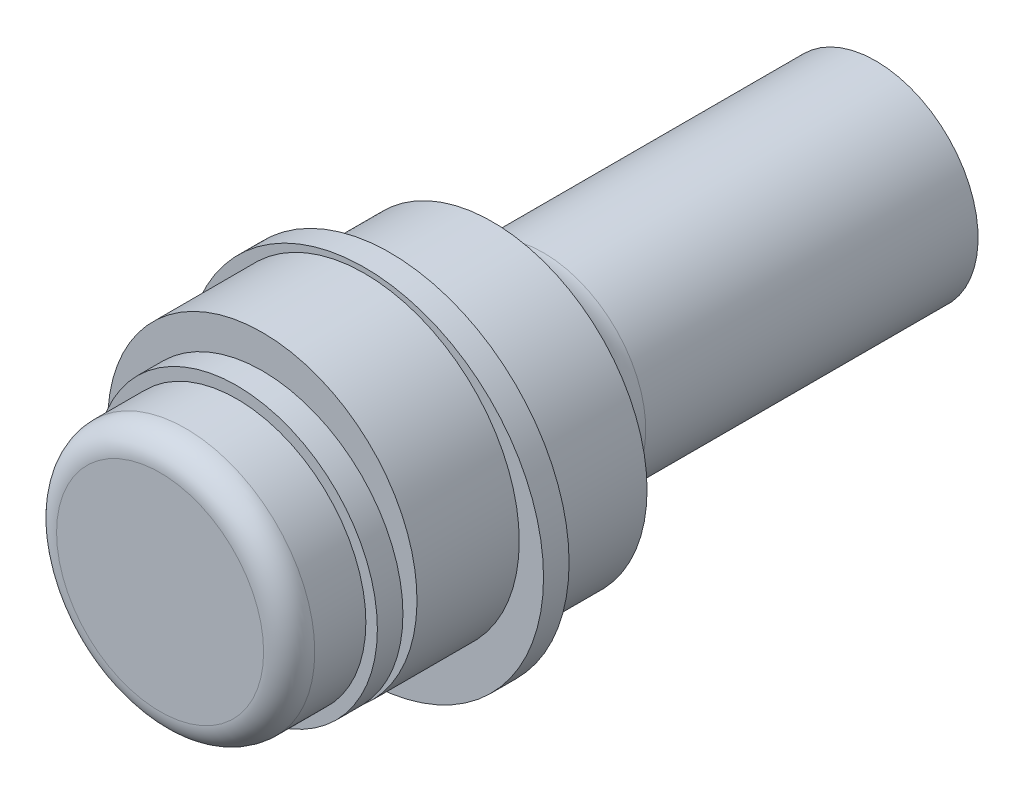
ISO-10303-21;
HEADER;
FILE_DESCRIPTION(('STEP AP214'),'2;1');
FILE_NAME('part.step','',(''),(''),'','','');
FILE_SCHEMA(('AUTOMOTIVE_DESIGN { 1 0 10303 214 1 1 1 1 }'));
ENDSEC;
DATA;
#1=APPLICATION_CONTEXT('core data for automotive mechanical design processes');
#2=APPLICATION_PROTOCOL_DEFINITION('international standard','automotive_design',2000,#1);
#3=PRODUCT_CONTEXT('',#1,'mechanical');
#4=PRODUCT('Part','Part','',(#3));
#5=PRODUCT_RELATED_PRODUCT_CATEGORY('part','',(#4));
#6=PRODUCT_DEFINITION_FORMATION('','',#4);
#7=PRODUCT_DEFINITION_CONTEXT('part definition',#1,'design');
#8=PRODUCT_DEFINITION('design','',#6,#7);
#9=PRODUCT_DEFINITION_SHAPE('','',#8);
#10=(LENGTH_UNIT() NAMED_UNIT(*) SI_UNIT(.MILLI.,.METRE.));
#11=(NAMED_UNIT(*) PLANE_ANGLE_UNIT() SI_UNIT($,.RADIAN.));
#12=(NAMED_UNIT(*) SI_UNIT($,.STERADIAN.) SOLID_ANGLE_UNIT());
#13=UNCERTAINTY_MEASURE_WITH_UNIT(LENGTH_MEASURE(1.E-05),#10,'distance_accuracy_value','');
#14=(GEOMETRIC_REPRESENTATION_CONTEXT(3) GLOBAL_UNCERTAINTY_ASSIGNED_CONTEXT((#13)) GLOBAL_UNIT_ASSIGNED_CONTEXT((#10,
#11,#12)) REPRESENTATION_CONTEXT('',''));
#15=CARTESIAN_POINT('',(0.,0.,0.));
#16=DIRECTION('',(0.,0.,1.));
#17=DIRECTION('',(1.,0.,0.));
#18=AXIS2_PLACEMENT_3D('',#15,#16,#17);
#19=CARTESIAN_POINT('',(0.,0.,5.));
#20=DIRECTION('',(0.,0.,-1.));
#21=DIRECTION('',(-1.,0.,0.));
#22=AXIS2_PLACEMENT_3D('',#19,#20,#21);
#23=CYLINDRICAL_SURFACE('',#22,6.05);
#24=CARTESIAN_POINT('',(0.,0.,0.));
#25=DIRECTION('',(0.,0.,1.));
#26=DIRECTION('',(1.,0.,0.));
#27=AXIS2_PLACEMENT_3D('',#24,#25,#26);
#28=CIRCLE('',#27,6.05);
#29=CARTESIAN_POINT('',(6.05,0.,0.));
#30=VERTEX_POINT('',#29);
#31=EDGE_CURVE('E128',#30,#30,#28,.T.);
#32=ORIENTED_EDGE('',*,*,#31,.T.);
#33=EDGE_LOOP('',(#32));
#34=FACE_BOUND('',#33,.T.);
#35=CARTESIAN_POINT('',(0.,0.,4.));
#36=DIRECTION('',(0.,0.,1.));
#37=DIRECTION('',(1.,0.,0.));
#38=AXIS2_PLACEMENT_3D('',#35,#36,#37);
#39=CIRCLE('',#38,6.05);
#40=CARTESIAN_POINT('',(6.05,0.,4.));
#41=VERTEX_POINT('',#40);
#42=EDGE_CURVE('E124',#41,#41,#39,.T.);
#43=ORIENTED_EDGE('',*,*,#42,.F.);
#44=EDGE_LOOP('',(#43));
#45=FACE_BOUND('',#44,.T.);
#46=ADVANCED_FACE('F43',(#34,#45),#23,.T.);
#47=CARTESIAN_POINT('',(0.,0.,0.));
#48=DIRECTION('',(0.,0.,1.));
#49=DIRECTION('',(1.,0.,0.));
#50=AXIS2_PLACEMENT_3D('',#47,#48,#49);
#51=PLANE('',#50);
#52=CARTESIAN_POINT('',(0.,0.,0.));
#53=DIRECTION('',(0.,0.,1.));
#54=DIRECTION('',(1.,0.,0.));
#55=AXIS2_PLACEMENT_3D('',#52,#53,#54);
#56=CIRCLE('',#55,6.);
#57=CARTESIAN_POINT('',(3.3166247903554,-5.,0.));
#58=VERTEX_POINT('',#57);
#59=CARTESIAN_POINT('',(-3.3166247903554,-5.,0.));
#60=VERTEX_POINT('',#59);
#61=EDGE_CURVE('E64',#58,#60,#56,.T.);
#62=ORIENTED_EDGE('',*,*,#61,.T.);
#63=DIRECTION('',(-1.,0.,0.));
#64=VECTOR('',#63,1.);
#65=CARTESIAN_POINT('',(2.64575131106459,-5.,0.));
#66=LINE('',#65,#64);
#67=EDGE_CURVE('E138',#60,#58,#66,.F.);
#68=ORIENTED_EDGE('',*,*,#67,.T.);
#69=EDGE_LOOP('',(#62,#68));
#70=FACE_BOUND('',#69,.T.);
#71=ORIENTED_EDGE('',*,*,#31,.F.);
#72=EDGE_LOOP('',(#71));
#73=FACE_BOUND('',#72,.T.);
#74=ADVANCED_FACE('F167',(#70,#73),#51,.F.);
#75=CARTESIAN_POINT('',(0.,0.,4.));
#76=DIRECTION('',(0.,0.,1.));
#77=DIRECTION('',(1.,0.,0.));
#78=AXIS2_PLACEMENT_3D('',#75,#76,#77);
#79=CYLINDRICAL_SURFACE('',#78,7.);
#80=CARTESIAN_POINT('',(0.,0.,4.));
#81=DIRECTION('',(0.,0.,1.));
#82=DIRECTION('',(1.,0.,0.));
#83=AXIS2_PLACEMENT_3D('',#80,#81,#82);
#84=CIRCLE('',#83,7.);
#85=CARTESIAN_POINT('',(7.,0.,4.));
#86=VERTEX_POINT('',#85);
#87=EDGE_CURVE('E125',#86,#86,#84,.T.);
#88=ORIENTED_EDGE('',*,*,#87,.T.);
#89=EDGE_LOOP('',(#88));
#90=FACE_BOUND('',#89,.T.);
#91=CARTESIAN_POINT('',(0.,0.,5.));
#92=DIRECTION('',(0.,0.,1.));
#93=DIRECTION('',(1.,0.,0.));
#94=AXIS2_PLACEMENT_3D('',#91,#92,#93);
#95=CIRCLE('',#94,7.);
#96=CARTESIAN_POINT('',(7.,0.,5.));
#97=VERTEX_POINT('',#96);
#98=EDGE_CURVE('E92',#97,#97,#95,.T.);
#99=ORIENTED_EDGE('',*,*,#98,.F.);
#100=EDGE_LOOP('',(#99));
#101=FACE_BOUND('',#100,.T.);
#102=ADVANCED_FACE('F172',(#90,#101),#79,.T.);
#103=CARTESIAN_POINT('',(0.,0.,4.));
#104=DIRECTION('',(0.,0.,1.));
#105=DIRECTION('',(1.,0.,0.));
#106=AXIS2_PLACEMENT_3D('',#103,#104,#105);
#107=PLANE('',#106);
#108=ORIENTED_EDGE('',*,*,#42,.T.);
#109=EDGE_LOOP('',(#108));
#110=FACE_BOUND('',#109,.T.);
#111=ORIENTED_EDGE('',*,*,#87,.F.);
#112=EDGE_LOOP('',(#111));
#113=FACE_BOUND('',#112,.T.);
#114=ADVANCED_FACE('F179',(#110,#113),#107,.F.);
#115=CARTESIAN_POINT('',(0.,0.,5.));
#116=DIRECTION('',(0.,0.,1.));
#117=DIRECTION('',(1.,0.,0.));
#118=AXIS2_PLACEMENT_3D('',#115,#116,#117);
#119=PLANE('',#118);
#120=CARTESIAN_POINT('',(0.,0.75,5.));
#121=DIRECTION('',(0.,0.,1.));
#122=DIRECTION('',(1.,0.,0.));
#123=AXIS2_PLACEMENT_3D('',#120,#121,#122);
#124=CIRCLE('',#123,6.05);
#125=CARTESIAN_POINT('',(6.05,0.75,5.));
#126=VERTEX_POINT('',#125);
#127=EDGE_CURVE('E120',#126,#126,#124,.T.);
#128=ORIENTED_EDGE('',*,*,#127,.F.);
#129=EDGE_LOOP('',(#128));
#130=FACE_BOUND('',#129,.T.);
#131=ORIENTED_EDGE('',*,*,#98,.T.);
#132=EDGE_LOOP('',(#131));
#133=FACE_BOUND('',#132,.T.);
#134=ADVANCED_FACE('F176',(#130,#133),#119,.T.);
#135=CARTESIAN_POINT('',(0.,0.75,9.));
#136=DIRECTION('',(0.,0.,-1.));
#137=DIRECTION('',(-1.,0.,0.));
#138=AXIS2_PLACEMENT_3D('',#135,#136,#137);
#139=CYLINDRICAL_SURFACE('',#138,6.05);
#140=CARTESIAN_POINT('',(0.,0.75,9.));
#141=DIRECTION('',(0.,0.,1.));
#142=DIRECTION('',(1.,0.,0.));
#143=AXIS2_PLACEMENT_3D('',#140,#141,#142);
#144=CIRCLE('',#143,6.05);
#145=CARTESIAN_POINT('',(-3.91795865215548,-3.86,9.));
#146=VERTEX_POINT('',#145);
#147=CARTESIAN_POINT('',(3.91795865215548,-3.86,9.));
#148=VERTEX_POINT('',#147);
#149=EDGE_CURVE('E85',#146,#148,#144,.T.);
#150=ORIENTED_EDGE('',*,*,#149,.F.);
#151=EDGE_CURVE('E88',#148,#146,#144,.T.);
#152=ORIENTED_EDGE('',*,*,#151,.F.);
#153=EDGE_LOOP('',(#150,#152));
#154=FACE_BOUND('',#153,.T.);
#155=ORIENTED_EDGE('',*,*,#127,.T.);
#156=EDGE_LOOP('',(#155));
#157=FACE_BOUND('',#156,.T.);
#158=ADVANCED_FACE('F86',(#154,#157),#139,.T.);
#159=CARTESIAN_POINT('',(0.,0.75,9.));
#160=DIRECTION('',(0.,0.,1.));
#161=DIRECTION('',(1.,0.,0.));
#162=AXIS2_PLACEMENT_3D('',#159,#160,#161);
#163=PLANE('',#162);
#164=CARTESIAN_POINT('',(0.,0.,9.));
#165=DIRECTION('',(0.,0.,1.));
#166=DIRECTION('',(1.,0.,0.));
#167=AXIS2_PLACEMENT_3D('',#164,#165,#166);
#168=CIRCLE('',#167,5.5);
#169=EDGE_CURVE('E57',#148,#146,#168,.T.);
#170=ORIENTED_EDGE('',*,*,#169,.F.);
#171=ORIENTED_EDGE('',*,*,#151,.T.);
#172=EDGE_LOOP('',(#170,#171));
#173=FACE_BOUND('',#172,.T.);
#174=ADVANCED_FACE('F94',(#173),#163,.T.);
#175=CARTESIAN_POINT('',(0.,-3.,-15.));
#176=DIRECTION('',(0.,1.,0.));
#177=DIRECTION('',(0.,0.,1.));
#178=AXIS2_PLACEMENT_3D('',#175,#176,#177);
#179=PLANE('',#178);
#180=DIRECTION('',(0.,0.,1.));
#181=VECTOR('',#180,1.);
#182=CARTESIAN_POINT('',(2.64575131106459,-3.,-15.));
#183=LINE('',#182,#181);
#184=CARTESIAN_POINT('',(2.64575131106459,-3.,-15.));
#185=VERTEX_POINT('',#184);
#186=CARTESIAN_POINT('',(2.64575131106459,-3.,-2.));
#187=VERTEX_POINT('',#186);
#188=EDGE_CURVE('E115',#185,#187,#183,.T.);
#189=ORIENTED_EDGE('',*,*,#188,.T.);
#190=DIRECTION('',(-1.,0.,0.));
#191=VECTOR('',#190,1.);
#192=CARTESIAN_POINT('',(-2.64575131106459,-3.,-2.));
#193=LINE('',#192,#191);
#194=CARTESIAN_POINT('',(-2.64575131106459,-3.,-2.));
#195=VERTEX_POINT('',#194);
#196=EDGE_CURVE('E123',#187,#195,#193,.T.);
#197=ORIENTED_EDGE('',*,*,#196,.T.);
#198=DIRECTION('',(0.,0.,1.));
#199=VECTOR('',#198,1.);
#200=CARTESIAN_POINT('',(-2.64575131106459,-3.,-15.));
#201=LINE('',#200,#199);
#202=CARTESIAN_POINT('',(-2.64575131106459,-3.,-15.));
#203=VERTEX_POINT('',#202);
#204=EDGE_CURVE('E95',#203,#195,#201,.T.);
#205=ORIENTED_EDGE('',*,*,#204,.F.);
#206=DIRECTION('',(-1.,0.,0.));
#207=VECTOR('',#206,1.);
#208=CARTESIAN_POINT('',(0.,-3.,-15.));
#209=LINE('',#208,#207);
#210=EDGE_CURVE('E109',#185,#203,#209,.T.);
#211=ORIENTED_EDGE('',*,*,#210,.F.);
#212=EDGE_LOOP('',(#189,#197,#205,#211));
#213=FACE_BOUND('',#212,.T.);
#214=ADVANCED_FACE('F191',(#213),#179,.F.);
#215=CARTESIAN_POINT('',(0.,0.,-15.));
#216=DIRECTION('',(0.,0.,1.));
#217=DIRECTION('',(1.,0.,0.));
#218=AXIS2_PLACEMENT_3D('',#215,#216,#217);
#219=CYLINDRICAL_SURFACE('',#218,4.);
#220=ORIENTED_EDGE('',*,*,#204,.T.);
#221=CARTESIAN_POINT('',(0.,0.,-2.));
#222=DIRECTION('',(0.,0.,1.));
#223=DIRECTION('',(1.,0.,0.));
#224=AXIS2_PLACEMENT_3D('',#221,#222,#223);
#225=CIRCLE('',#224,4.);
#226=EDGE_CURVE('E100',#195,#187,#225,.F.);
#227=ORIENTED_EDGE('',*,*,#226,.T.);
#228=ORIENTED_EDGE('',*,*,#188,.F.);
#229=CARTESIAN_POINT('',(0.,0.,-15.));
#230=DIRECTION('',(0.,0.,-1.));
#231=DIRECTION('',(-1.,0.,0.));
#232=AXIS2_PLACEMENT_3D('',#229,#230,#231);
#233=CIRCLE('',#232,4.);
#234=EDGE_CURVE('E112',#203,#185,#233,.T.);
#235=ORIENTED_EDGE('',*,*,#234,.F.);
#236=EDGE_LOOP('',(#220,#227,#228,#235));
#237=FACE_BOUND('',#236,.T.);
#238=ADVANCED_FACE('F194',(#237),#219,.T.);
#239=CARTESIAN_POINT('',(0.,0.,-15.));
#240=DIRECTION('',(0.,0.,-1.));
#241=DIRECTION('',(-1.,0.,0.));
#242=AXIS2_PLACEMENT_3D('',#239,#240,#241);
#243=PLANE('',#242);
#244=ORIENTED_EDGE('',*,*,#210,.T.);
#245=ORIENTED_EDGE('',*,*,#234,.T.);
#246=EDGE_LOOP('',(#244,#245));
#247=FACE_BOUND('',#246,.T.);
#248=ADVANCED_FACE('F164',(#247),#243,.T.);
#249=CARTESIAN_POINT('',(0.,0.,-2.));
#250=DIRECTION('',(0.,0.,1.));
#251=DIRECTION('',(1.,0.,0.));
#252=AXIS2_PLACEMENT_3D('',#249,#250,#251);
#253=TOROIDAL_SURFACE('',#252,6.,2.);
#254=CARTESIAN_POINT('',(-2.64575131106459,-3.,-2.));
#255=CARTESIAN_POINT('',(-2.64574700652593,-2.99999277685629,-1.94618369219935));
#256=CARTESIAN_POINT('',(-2.6465722153536,-3.00217200651263,-1.89237143815969));
#257=CARTESIAN_POINT('',(-2.64984909947138,-3.0108476796075,-1.78515688869861));
#258=CARTESIAN_POINT('',(-2.65230043412225,-3.01734321887023,-1.73175450978645));
#259=CARTESIAN_POINT('',(-2.65878839727144,-3.03457292404722,-1.62587964886446));
#260=CARTESIAN_POINT('',(-2.66282079296217,-3.0452957730477,-1.573405071756));
#261=CARTESIAN_POINT('',(-2.67240565088669,-3.07086452871577,-1.46962617296868));
#262=CARTESIAN_POINT('',(-2.67795814427517,-3.08571051988799,-1.41832187529826));
#263=CARTESIAN_POINT('',(-2.69678018868313,-3.13623238670546,-1.26673014193536));
#264=CARTESIAN_POINT('',(-2.71222246113275,-3.17791349122849,-1.16863453699561));
#265=CARTESIAN_POINT('',(-2.74807203342138,-3.27579049571232,-0.981018304003021));
#266=CARTESIAN_POINT('',(-2.76848127167502,-3.33199206297698,-0.891501042801948));
#267=CARTESIAN_POINT('',(-2.81401841266613,-3.45908352409341,-0.720442422189504));
#268=CARTESIAN_POINT('',(-2.8392718414682,-3.53037105125532,-0.639229897914399));
#269=CARTESIAN_POINT('',(-2.89301652382005,-3.68441142433156,-0.489783625603222));
#270=CARTESIAN_POINT('',(-2.9215088806313,-3.76716817907354,-0.421554321271247));
#271=CARTESIAN_POINT('',(-2.98244378709844,-3.94699539113555,-0.295917736918265));
#272=CARTESIAN_POINT('',(-3.01501944863797,-4.04461655269054,-0.239363319547674));
#273=CARTESIAN_POINT('',(-3.08159553860926,-4.24756202264203,-0.143545862983495));
#274=CARTESIAN_POINT('',(-3.1155959318086,-4.3528861405988,-0.104282396475169));
#275=CARTESIAN_POINT('',(-3.17707296807564,-4.5465227450315,-0.0500438206117948));
#276=CARTESIAN_POINT('',(-3.20447431751725,-4.63395362290888,-0.0317579145093514));
#277=CARTESIAN_POINT('',(-3.25907441424468,-4.81041192667689,-0.00702125797014727));
#278=CARTESIAN_POINT('',(-3.28627345936419,-4.89943576259059,-0.000546625696997057));
#279=CARTESIAN_POINT('',(-3.31430907279492,-4.99232162983134,-1.10262460800456E-05));
#280=CARTESIAN_POINT('',(-3.3154672410005,-4.99616082816347,3.04331810236306E-08));
#281=CARTESIAN_POINT('',(-3.3166247903554,-5.,0.));
#282=B_SPLINE_CURVE_WITH_KNOTS('',3,(#254,#255,#256,#257,#258,#259,#260,#261,#262,#263,#264,
#265,#266,#267,#268,#269,#270,#271,#272,#273,#274,#275,#276,#277,#278,#279,#280,#281),
.UNSPECIFIED.,.F.,.F.,(4,2,2,2,2,2,2,2,2,2,2,2,2,4),(0.,0.161391568731043,0.322749339986934,
0.48367804279577,0.64461004411458,0.966085026229121,1.28768566934757,1.61915004097009,
1.95072765804836,2.30145994104871,2.65218355584533,2.93178295929152,3.21081639670522,
3.22284663146018),.UNSPECIFIED.);
#283=EDGE_CURVE('E105',#60,#195,#282,.F.);
#284=ORIENTED_EDGE('',*,*,#283,.F.);
#285=ORIENTED_EDGE('',*,*,#61,.F.);
#286=CARTESIAN_POINT('',(2.64575131106459,-3.,-2.));
#287=CARTESIAN_POINT('',(2.64574700652593,-2.99999277685629,-1.94618369219935));
#288=CARTESIAN_POINT('',(2.6465722153536,-3.00217200651263,-1.89237143815969));
#289=CARTESIAN_POINT('',(2.64984909947138,-3.0108476796075,-1.78515688869861));
#290=CARTESIAN_POINT('',(2.65230043412225,-3.01734321887023,-1.73175450978645));
#291=CARTESIAN_POINT('',(2.65878839727144,-3.03457292404722,-1.62587964886446));
#292=CARTESIAN_POINT('',(2.66282079296217,-3.0452957730477,-1.573405071756));
#293=CARTESIAN_POINT('',(2.67240565088669,-3.07086452871577,-1.46962617296868));
#294=CARTESIAN_POINT('',(2.67795814427517,-3.08571051988799,-1.41832187529826));
#295=CARTESIAN_POINT('',(2.69678018868313,-3.13623238670546,-1.26673014193536));
#296=CARTESIAN_POINT('',(2.71222246113275,-3.17791349122849,-1.16863453699561));
#297=CARTESIAN_POINT('',(2.74807203342138,-3.27579049571232,-0.981018304003021));
#298=CARTESIAN_POINT('',(2.76848127167502,-3.33199206297698,-0.891501042801948));
#299=CARTESIAN_POINT('',(2.81401841266613,-3.45908352409341,-0.720442422189504));
#300=CARTESIAN_POINT('',(2.8392718414682,-3.53037105125532,-0.639229897914399));
#301=CARTESIAN_POINT('',(2.89301652382005,-3.68441142433156,-0.489783625603222));
#302=CARTESIAN_POINT('',(2.9215088806313,-3.76716817907354,-0.421554321271247));
#303=CARTESIAN_POINT('',(2.98244378709844,-3.94699539113555,-0.295917736918265));
#304=CARTESIAN_POINT('',(3.01501944863797,-4.04461655269054,-0.239363319547674));
#305=CARTESIAN_POINT('',(3.08159553860926,-4.24756202264203,-0.143545862983495));
#306=CARTESIAN_POINT('',(3.1155959318086,-4.3528861405988,-0.104282396475169));
#307=CARTESIAN_POINT('',(3.17707296807564,-4.5465227450315,-0.0500438206117948));
#308=CARTESIAN_POINT('',(3.20447431751725,-4.63395362290888,-0.0317579145093514));
#309=CARTESIAN_POINT('',(3.25907441424468,-4.81041192667689,-0.00702125797014727));
#310=CARTESIAN_POINT('',(3.28627345936419,-4.89943576259059,-0.000546625696997057));
#311=CARTESIAN_POINT('',(3.31430907279492,-4.99232162983134,-1.10262460800456E-05));
#312=CARTESIAN_POINT('',(3.3154672410005,-4.99616082816347,3.04331810236306E-08));
#313=CARTESIAN_POINT('',(3.3166247903554,-5.,0.));
#314=B_SPLINE_CURVE_WITH_KNOTS('',3,(#286,#287,#288,#289,#290,#291,#292,#293,#294,#295,#296,
#297,#298,#299,#300,#301,#302,#303,#304,#305,#306,#307,#308,#309,#310,#311,#312,#313),
.UNSPECIFIED.,.F.,.F.,(4,2,2,2,2,2,2,2,2,2,2,2,2,4),(0.,0.161391568731043,0.322749339986934,
0.48367804279577,0.64461004411458,0.966085026229121,1.28768566934757,1.61915004097009,
1.95072765804836,2.30145994104871,2.65218355584533,2.93178295929152,3.21081639670522,
3.22284663146018),.UNSPECIFIED.);
#315=EDGE_CURVE('E113',#187,#58,#314,.T.);
#316=ORIENTED_EDGE('',*,*,#315,.F.);
#317=ORIENTED_EDGE('',*,*,#226,.F.);
#318=EDGE_LOOP('',(#284,#285,#316,#317));
#319=FACE_BOUND('',#318,.T.);
#320=ADVANCED_FACE('F151',(#319),#253,.F.);
#321=CARTESIAN_POINT('',(0.,-5.,-2.));
#322=DIRECTION('',(1.,0.,0.));
#323=DIRECTION('',(0.,0.,-1.));
#324=AXIS2_PLACEMENT_3D('',#321,#322,#323);
#325=CYLINDRICAL_SURFACE('',#324,2.);
#326=ORIENTED_EDGE('',*,*,#315,.T.);
#327=ORIENTED_EDGE('',*,*,#67,.F.);
#328=ORIENTED_EDGE('',*,*,#283,.T.);
#329=ORIENTED_EDGE('',*,*,#196,.F.);
#330=EDGE_LOOP('',(#326,#327,#328,#329));
#331=FACE_BOUND('',#330,.T.);
#332=ADVANCED_FACE('F154',(#331),#325,.F.);
#333=CARTESIAN_POINT('',(0.,0.,9.));
#334=DIRECTION('',(0.,0.,1.));
#335=DIRECTION('',(1.,0.,0.));
#336=AXIS2_PLACEMENT_3D('',#333,#334,#335);
#337=PLANE('',#336);
#338=EDGE_CURVE('E98',#146,#148,#168,.T.);
#339=ORIENTED_EDGE('',*,*,#338,.F.);
#340=ORIENTED_EDGE('',*,*,#149,.T.);
#341=EDGE_LOOP('',(#339,#340));
#342=FACE_BOUND('',#341,.T.);
#343=ADVANCED_FACE('F102',(#342),#337,.F.);
#344=CARTESIAN_POINT('',(0.,0.,10.));
#345=DIRECTION('',(0.,0.,-1.));
#346=DIRECTION('',(-1.,0.,0.));
#347=AXIS2_PLACEMENT_3D('',#344,#345,#346);
#348=CYLINDRICAL_SURFACE('',#347,5.5);
#349=CARTESIAN_POINT('',(0.,0.,10.));
#350=DIRECTION('',(0.,0.,1.));
#351=DIRECTION('',(1.,0.,0.));
#352=AXIS2_PLACEMENT_3D('',#349,#350,#351);
#353=CIRCLE('',#352,5.5);
#354=CARTESIAN_POINT('',(5.5,0.,10.));
#355=VERTEX_POINT('',#354);
#356=EDGE_CURVE('E103',#355,#355,#353,.T.);
#357=ORIENTED_EDGE('',*,*,#356,.F.);
#358=EDGE_LOOP('',(#357));
#359=FACE_BOUND('',#358,.T.);
#360=ORIENTED_EDGE('',*,*,#338,.T.);
#361=ORIENTED_EDGE('',*,*,#169,.T.);
#362=EDGE_LOOP('',(#360,#361));
#363=FACE_BOUND('',#362,.T.);
#364=ADVANCED_FACE('F97',(#359,#363),#348,.T.);
#365=CARTESIAN_POINT('',(0.,0.,10.));
#366=DIRECTION('',(0.,0.,1.));
#367=DIRECTION('',(1.,0.,0.));
#368=AXIS2_PLACEMENT_3D('',#365,#366,#367);
#369=PLANE('',#368);
#370=CARTESIAN_POINT('',(0.,0.,10.));
#371=DIRECTION('',(0.,0.,1.));
#372=DIRECTION('',(1.,0.,0.));
#373=AXIS2_PLACEMENT_3D('',#370,#371,#372);
#374=CIRCLE('',#373,5.05);
#375=CARTESIAN_POINT('',(5.05,0.,10.));
#376=VERTEX_POINT('',#375);
#377=EDGE_CURVE('E99',#376,#376,#374,.T.);
#378=ORIENTED_EDGE('',*,*,#377,.F.);
#379=EDGE_LOOP('',(#378));
#380=FACE_BOUND('',#379,.T.);
#381=ORIENTED_EDGE('',*,*,#356,.T.);
#382=EDGE_LOOP('',(#381));
#383=FACE_BOUND('',#382,.T.);
#384=ADVANCED_FACE('F203',(#380,#383),#369,.T.);
#385=CARTESIAN_POINT('',(0.,0.,13.));
#386=DIRECTION('',(0.,0.,-1.));
#387=DIRECTION('',(-1.,0.,0.));
#388=AXIS2_PLACEMENT_3D('',#385,#386,#387);
#389=CYLINDRICAL_SURFACE('',#388,5.05);
#390=CARTESIAN_POINT('',(0.,0.,12.));
#391=DIRECTION('',(0.,0.,1.));
#392=DIRECTION('',(1.,0.,0.));
#393=AXIS2_PLACEMENT_3D('',#390,#391,#392);
#394=CIRCLE('',#393,5.05);
#395=CARTESIAN_POINT('',(5.05,0.,12.));
#396=VERTEX_POINT('',#395);
#397=EDGE_CURVE('E11',#396,#396,#394,.F.);
#398=ORIENTED_EDGE('',*,*,#397,.T.);
#399=EDGE_LOOP('',(#398));
#400=FACE_BOUND('',#399,.T.);
#401=ORIENTED_EDGE('',*,*,#377,.T.);
#402=EDGE_LOOP('',(#401));
#403=FACE_BOUND('',#402,.T.);
#404=ADVANCED_FACE('F208',(#400,#403),#389,.T.);
#405=CARTESIAN_POINT('',(0.,0.,13.));
#406=DIRECTION('',(0.,0.,1.));
#407=DIRECTION('',(1.,0.,0.));
#408=AXIS2_PLACEMENT_3D('',#405,#406,#407);
#409=PLANE('',#408);
#410=CARTESIAN_POINT('',(0.,0.,13.));
#411=DIRECTION('',(0.,0.,1.));
#412=DIRECTION('',(1.,0.,0.));
#413=AXIS2_PLACEMENT_3D('',#410,#411,#412);
#414=CIRCLE('',#413,4.05);
#415=CARTESIAN_POINT('',(4.05,0.,13.));
#416=VERTEX_POINT('',#415);
#417=EDGE_CURVE('E51',#416,#416,#414,.T.);
#418=ORIENTED_EDGE('',*,*,#417,.T.);
#419=EDGE_LOOP('',(#418));
#420=FACE_BOUND('',#419,.T.);
#421=ADVANCED_FACE('F212',(#420),#409,.T.);
#422=CARTESIAN_POINT('',(0.,0.,12.));
#423=DIRECTION('',(0.,0.,1.));
#424=DIRECTION('',(1.,0.,0.));
#425=AXIS2_PLACEMENT_3D('',#422,#423,#424);
#426=TOROIDAL_SURFACE('',#425,4.05,1.);
#427=ORIENTED_EDGE('',*,*,#397,.F.);
#428=EDGE_LOOP('',(#427));
#429=FACE_BOUND('',#428,.T.);
#430=ORIENTED_EDGE('',*,*,#417,.F.);
#431=EDGE_LOOP('',(#430));
#432=FACE_BOUND('',#431,.T.);
#433=ADVANCED_FACE('F45',(#429,#432),#426,.T.);
#434=CLOSED_SHELL('',(#46,#74,#102,#114,#134,#158,#174,#214,#238,#248,#320,#332,#343,#364,#384,
#404,#421,#433));
#435=MANIFOLD_SOLID_BREP('B2',#434);
#436=ADVANCED_BREP_SHAPE_REPRESENTATION('',(#18,#435),#14);
#437=SHAPE_DEFINITION_REPRESENTATION(#9,#436);
ENDSEC;
END-ISO-10303-21;
